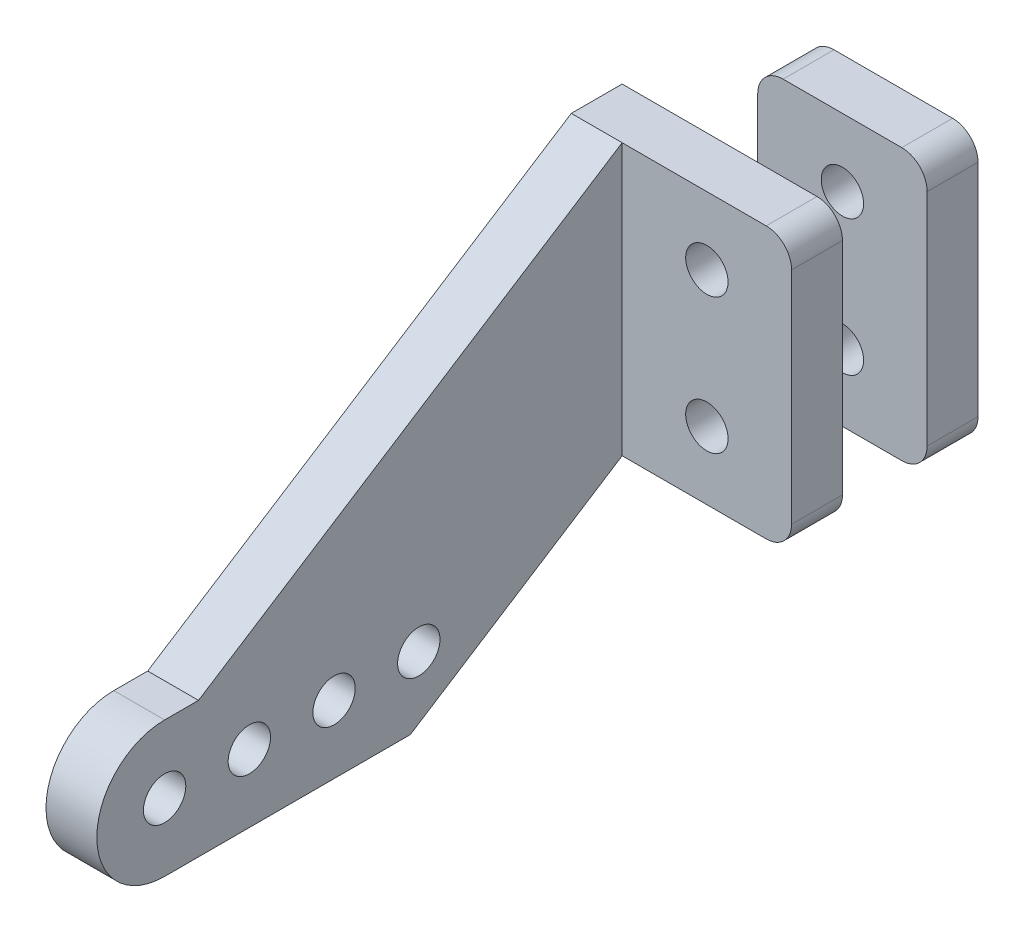
ISO-10303-21;
HEADER;
FILE_DESCRIPTION(('STEP AP214'),'2;1');
FILE_NAME('part.step','',(''),(''),'','','');
FILE_SCHEMA(('AUTOMOTIVE_DESIGN { 1 0 10303 214 1 1 1 1 }'));
ENDSEC;
DATA;
#1=APPLICATION_CONTEXT('core data for automotive mechanical design processes');
#2=APPLICATION_PROTOCOL_DEFINITION('international standard','automotive_design',2000,#1);
#3=PRODUCT_CONTEXT('',#1,'mechanical');
#4=PRODUCT('Part','Part','',(#3));
#5=PRODUCT_RELATED_PRODUCT_CATEGORY('part','',(#4));
#6=PRODUCT_DEFINITION_FORMATION('','',#4);
#7=PRODUCT_DEFINITION_CONTEXT('part definition',#1,'design');
#8=PRODUCT_DEFINITION('design','',#6,#7);
#9=PRODUCT_DEFINITION_SHAPE('','',#8);
#10=(LENGTH_UNIT() NAMED_UNIT(*) SI_UNIT(.MILLI.,.METRE.));
#11=(NAMED_UNIT(*) PLANE_ANGLE_UNIT() SI_UNIT($,.RADIAN.));
#12=(NAMED_UNIT(*) SI_UNIT($,.STERADIAN.) SOLID_ANGLE_UNIT());
#13=UNCERTAINTY_MEASURE_WITH_UNIT(LENGTH_MEASURE(1.E-05),#10,'distance_accuracy_value','');
#14=(GEOMETRIC_REPRESENTATION_CONTEXT(3) GLOBAL_UNCERTAINTY_ASSIGNED_CONTEXT((#13)) GLOBAL_UNIT_ASSIGNED_CONTEXT((#10,
#11,#12)) REPRESENTATION_CONTEXT('',''));
#15=CARTESIAN_POINT('',(0.,0.,0.));
#16=DIRECTION('',(0.,0.,1.));
#17=DIRECTION('',(1.,0.,0.));
#18=AXIS2_PLACEMENT_3D('',#15,#16,#17);
#19=CARTESIAN_POINT('',(8.,373.5,4.));
#20=DIRECTION('',(0.,0.,1.));
#21=DIRECTION('',(1.,0.,0.));
#22=AXIS2_PLACEMENT_3D('',#19,#20,#21);
#23=CYLINDRICAL_SURFACE('',#22,1.25);
#24=CARTESIAN_POINT('',(8.,373.5,2.5));
#25=DIRECTION('',(0.,0.,1.));
#26=DIRECTION('',(1.,0.,0.));
#27=AXIS2_PLACEMENT_3D('',#24,#25,#26);
#28=CIRCLE('',#27,1.25);
#29=CARTESIAN_POINT('',(9.25,373.5,2.5));
#30=VERTEX_POINT('',#29);
#31=EDGE_CURVE('P0_E114',#30,#30,#28,.T.);
#32=ORIENTED_EDGE('',*,*,#31,.F.);
#33=EDGE_LOOP('',(#32));
#34=FACE_BOUND('',#33,.T.);
#35=CARTESIAN_POINT('',(8.,373.5,5.5));
#36=DIRECTION('',(0.,0.,1.));
#37=DIRECTION('',(1.,0.,0.));
#38=AXIS2_PLACEMENT_3D('',#35,#36,#37);
#39=CIRCLE('',#38,1.25);
#40=CARTESIAN_POINT('',(9.25,373.5,5.5));
#41=VERTEX_POINT('',#40);
#42=EDGE_CURVE('P0_E203',#41,#41,#39,.T.);
#43=ORIENTED_EDGE('',*,*,#42,.T.);
#44=EDGE_LOOP('',(#43));
#45=FACE_BOUND('',#44,.T.);
#46=ADVANCED_FACE('P0_F15',(#34,#45),#23,.F.);
#47=CARTESIAN_POINT('',(8.,365.5,4.));
#48=DIRECTION('',(0.,0.,1.));
#49=DIRECTION('',(1.,0.,0.));
#50=AXIS2_PLACEMENT_3D('',#47,#48,#49);
#51=CYLINDRICAL_SURFACE('',#50,1.25);
#52=CARTESIAN_POINT('',(8.,365.5,2.5));
#53=DIRECTION('',(0.,0.,1.));
#54=DIRECTION('',(1.,0.,0.));
#55=AXIS2_PLACEMENT_3D('',#52,#53,#54);
#56=CIRCLE('',#55,1.25);
#57=CARTESIAN_POINT('',(9.25,365.5,2.5));
#58=VERTEX_POINT('',#57);
#59=EDGE_CURVE('P0_E189',#58,#58,#56,.T.);
#60=ORIENTED_EDGE('',*,*,#59,.F.);
#61=EDGE_LOOP('',(#60));
#62=FACE_BOUND('',#61,.T.);
#63=CARTESIAN_POINT('',(8.,365.5,5.5));
#64=DIRECTION('',(0.,0.,1.));
#65=DIRECTION('',(1.,0.,0.));
#66=AXIS2_PLACEMENT_3D('',#63,#64,#65);
#67=CIRCLE('',#66,1.25);
#68=CARTESIAN_POINT('',(9.25,365.5,5.5));
#69=VERTEX_POINT('',#68);
#70=EDGE_CURVE('P0_E205',#69,#69,#67,.T.);
#71=ORIENTED_EDGE('',*,*,#70,.T.);
#72=EDGE_LOOP('',(#71));
#73=FACE_BOUND('',#72,.T.);
#74=ADVANCED_FACE('P0_F374',(#62,#73),#51,.F.);
#75=CARTESIAN_POINT('',(11.5,376.,2.5));
#76=DIRECTION('',(0.,0.,1.));
#77=DIRECTION('',(1.,0.,0.));
#78=AXIS2_PLACEMENT_3D('',#75,#76,#77);
#79=CYLINDRICAL_SURFACE('',#78,1.5);
#80=CARTESIAN_POINT('',(11.5,376.,2.5));
#81=DIRECTION('',(0.,0.,1.));
#82=DIRECTION('',(1.,0.,0.));
#83=AXIS2_PLACEMENT_3D('',#80,#81,#82);
#84=CIRCLE('',#83,1.5);
#85=CARTESIAN_POINT('',(11.5,377.5,2.5));
#86=VERTEX_POINT('',#85);
#87=CARTESIAN_POINT('',(13.,376.,2.5));
#88=VERTEX_POINT('',#87);
#89=EDGE_CURVE('P0_E111',#86,#88,#84,.F.);
#90=ORIENTED_EDGE('',*,*,#89,.F.);
#91=DIRECTION('',(0.,0.,1.));
#92=VECTOR('',#91,1.);
#93=CARTESIAN_POINT('',(11.5,377.5,2.5));
#94=LINE('',#93,#92);
#95=CARTESIAN_POINT('',(11.5,377.5,5.5));
#96=VERTEX_POINT('',#95);
#97=EDGE_CURVE('P0_E108',#96,#86,#94,.F.);
#98=ORIENTED_EDGE('',*,*,#97,.F.);
#99=CARTESIAN_POINT('',(11.5,376.,5.5));
#100=DIRECTION('',(0.,0.,1.));
#101=DIRECTION('',(1.,0.,0.));
#102=AXIS2_PLACEMENT_3D('',#99,#100,#101);
#103=CIRCLE('',#102,1.5);
#104=CARTESIAN_POINT('',(13.,376.,5.5));
#105=VERTEX_POINT('',#104);
#106=EDGE_CURVE('P0_E19',#96,#105,#103,.F.);
#107=ORIENTED_EDGE('',*,*,#106,.T.);
#108=DIRECTION('',(0.,0.,-1.));
#109=VECTOR('',#108,1.);
#110=CARTESIAN_POINT('',(13.,376.,2.5));
#111=LINE('',#110,#109);
#112=EDGE_CURVE('P0_E106',#88,#105,#111,.F.);
#113=ORIENTED_EDGE('',*,*,#112,.F.);
#114=EDGE_LOOP('',(#90,#98,#107,#113));
#115=FACE_BOUND('',#114,.T.);
#116=ADVANCED_FACE('P0_F109',(#115),#79,.T.);
#117=CARTESIAN_POINT('',(13.,376.,2.5));
#118=DIRECTION('',(1.,0.,0.));
#119=DIRECTION('',(0.,0.,-1.));
#120=AXIS2_PLACEMENT_3D('',#117,#118,#119);
#121=PLANE('',#120);
#122=DIRECTION('',(0.,1.,0.));
#123=VECTOR('',#122,1.);
#124=CARTESIAN_POINT('',(13.,369.5,2.5));
#125=LINE('',#124,#123);
#126=CARTESIAN_POINT('',(13.,363.,2.5));
#127=VERTEX_POINT('',#126);
#128=EDGE_CURVE('P0_E187',#88,#127,#125,.F.);
#129=ORIENTED_EDGE('',*,*,#128,.F.);
#130=ORIENTED_EDGE('',*,*,#112,.T.);
#131=DIRECTION('',(0.,1.,0.));
#132=VECTOR('',#131,1.);
#133=CARTESIAN_POINT('',(13.,376.,5.5));
#134=LINE('',#133,#132);
#135=CARTESIAN_POINT('',(13.,363.,5.5));
#136=VERTEX_POINT('',#135);
#137=EDGE_CURVE('P0_E103',#105,#136,#134,.F.);
#138=ORIENTED_EDGE('',*,*,#137,.T.);
#139=DIRECTION('',(0.,0.,1.));
#140=VECTOR('',#139,1.);
#141=CARTESIAN_POINT('',(13.,363.,2.5));
#142=LINE('',#141,#140);
#143=EDGE_CURVE('P0_E135',#127,#136,#142,.T.);
#144=ORIENTED_EDGE('',*,*,#143,.F.);
#145=EDGE_LOOP('',(#129,#130,#138,#144));
#146=FACE_BOUND('',#145,.T.);
#147=ADVANCED_FACE('P0_F297',(#146),#121,.T.);
#148=CARTESIAN_POINT('',(13.,376.,5.5));
#149=DIRECTION('',(0.,0.,-1.));
#150=DIRECTION('',(-1.,0.,0.));
#151=AXIS2_PLACEMENT_3D('',#148,#149,#150);
#152=PLANE('',#151);
#153=ORIENTED_EDGE('',*,*,#42,.F.);
#154=EDGE_LOOP('',(#153));
#155=FACE_BOUND('',#154,.T.);
#156=ORIENTED_EDGE('',*,*,#70,.F.);
#157=EDGE_LOOP('',(#156));
#158=FACE_BOUND('',#157,.T.);
#159=DIRECTION('',(1.,0.,0.));
#160=VECTOR('',#159,1.);
#161=CARTESIAN_POINT('',(11.5,361.5,5.5));
#162=LINE('',#161,#160);
#163=CARTESIAN_POINT('',(11.5,361.5,5.5));
#164=VERTEX_POINT('',#163);
#165=CARTESIAN_POINT('',(3.,361.5,5.5));
#166=VERTEX_POINT('',#165);
#167=EDGE_CURVE('P0_E151',#164,#166,#162,.F.);
#168=ORIENTED_EDGE('',*,*,#167,.F.);
#169=CARTESIAN_POINT('',(11.5,363.,5.5));
#170=DIRECTION('',(0.,0.,1.));
#171=DIRECTION('',(1.,0.,0.));
#172=AXIS2_PLACEMENT_3D('',#169,#170,#171);
#173=CIRCLE('',#172,1.5);
#174=EDGE_CURVE('P0_E162',#136,#164,#173,.F.);
#175=ORIENTED_EDGE('',*,*,#174,.F.);
#176=ORIENTED_EDGE('',*,*,#137,.F.);
#177=ORIENTED_EDGE('',*,*,#106,.F.);
#178=DIRECTION('',(1.,0.,0.));
#179=VECTOR('',#178,1.);
#180=CARTESIAN_POINT('',(0.,377.5,5.5));
#181=LINE('',#180,#179);
#182=CARTESIAN_POINT('',(3.,377.5,5.49999999999999));
#183=VERTEX_POINT('',#182);
#184=EDGE_CURVE('P0_E100',#183,#96,#181,.T.);
#185=ORIENTED_EDGE('',*,*,#184,.F.);
#186=DIRECTION('',(0.,1.,0.));
#187=VECTOR('',#186,1.);
#188=CARTESIAN_POINT('',(3.,377.5,5.5));
#189=LINE('',#188,#187);
#190=EDGE_CURVE('P0_E132',#166,#183,#189,.T.);
#191=ORIENTED_EDGE('',*,*,#190,.F.);
#192=EDGE_LOOP('',(#168,#175,#176,#177,#185,#191));
#193=FACE_BOUND('',#192,.T.);
#194=ADVANCED_FACE('P0_F98',(#155,#158,#193),#152,.F.);
#195=CARTESIAN_POINT('',(11.5,363.,2.5));
#196=DIRECTION('',(0.,0.,1.));
#197=DIRECTION('',(1.,0.,0.));
#198=AXIS2_PLACEMENT_3D('',#195,#196,#197);
#199=CYLINDRICAL_SURFACE('',#198,1.5);
#200=CARTESIAN_POINT('',(11.5,363.,2.5));
#201=DIRECTION('',(0.,0.,1.));
#202=DIRECTION('',(1.,0.,0.));
#203=AXIS2_PLACEMENT_3D('',#200,#201,#202);
#204=CIRCLE('',#203,1.5);
#205=CARTESIAN_POINT('',(11.5,361.5,2.5));
#206=VERTEX_POINT('',#205);
#207=EDGE_CURVE('P0_E185',#127,#206,#204,.F.);
#208=ORIENTED_EDGE('',*,*,#207,.F.);
#209=ORIENTED_EDGE('',*,*,#143,.T.);
#210=ORIENTED_EDGE('',*,*,#174,.T.);
#211=DIRECTION('',(0.,0.,-1.));
#212=VECTOR('',#211,1.);
#213=CARTESIAN_POINT('',(11.5,361.5,2.5));
#214=LINE('',#213,#212);
#215=EDGE_CURVE('P0_E148',#206,#164,#214,.F.);
#216=ORIENTED_EDGE('',*,*,#215,.F.);
#217=EDGE_LOOP('',(#208,#209,#210,#216));
#218=FACE_BOUND('',#217,.T.);
#219=ADVANCED_FACE('P0_F295',(#218),#199,.T.);
#220=CARTESIAN_POINT('',(3.,377.5,5.5));
#221=DIRECTION('',(1.,0.,0.));
#222=DIRECTION('',(0.,0.,-1.));
#223=AXIS2_PLACEMENT_3D('',#220,#221,#222);
#224=PLANE('',#223);
#225=DIRECTION('',(0.,0.,-1.));
#226=VECTOR('',#225,1.);
#227=CARTESIAN_POINT('',(3.,353.5,18.));
#228=LINE('',#227,#226);
#229=CARTESIAN_POINT('',(3.,353.5,18.));
#230=VERTEX_POINT('',#229);
#231=CARTESIAN_POINT('',(3.,353.5,32.5));
#232=VERTEX_POINT('',#231);
#233=EDGE_CURVE('P0_E138',#230,#232,#228,.F.);
#234=ORIENTED_EDGE('',*,*,#233,.F.);
#235=DIRECTION('',(0.,0.539053696423367,-0.842271400661511));
#236=VECTOR('',#235,1.);
#237=CARTESIAN_POINT('',(3.,361.5,5.5));
#238=LINE('',#237,#236);
#239=EDGE_CURVE('P0_E145',#166,#230,#238,.F.);
#240=ORIENTED_EDGE('',*,*,#239,.F.);
#241=ORIENTED_EDGE('',*,*,#190,.T.);
#242=DIRECTION('',(0.,-0.539053696423367,0.842271400661511));
#243=VECTOR('',#242,1.);
#244=CARTESIAN_POINT('',(3.,361.5,30.5));
#245=LINE('',#244,#243);
#246=CARTESIAN_POINT('',(3.,361.5,30.5));
#247=VERTEX_POINT('',#246);
#248=EDGE_CURVE('P0_E228',#247,#183,#245,.F.);
#249=ORIENTED_EDGE('',*,*,#248,.F.);
#250=DIRECTION('',(0.,0.,1.));
#251=VECTOR('',#250,1.);
#252=CARTESIAN_POINT('',(3.,361.5,32.5));
#253=LINE('',#252,#251);
#254=CARTESIAN_POINT('',(3.,361.5,32.5));
#255=VERTEX_POINT('',#254);
#256=EDGE_CURVE('P0_E229',#255,#247,#253,.F.);
#257=ORIENTED_EDGE('',*,*,#256,.F.);
#258=CARTESIAN_POINT('',(3.,357.5,32.5));
#259=DIRECTION('',(1.,0.,0.));
#260=DIRECTION('',(0.,0.,-1.));
#261=AXIS2_PLACEMENT_3D('',#258,#259,#260);
#262=CIRCLE('',#261,4.);
#263=EDGE_CURVE('P0_E181',#232,#255,#262,.F.);
#264=ORIENTED_EDGE('',*,*,#263,.F.);
#265=EDGE_LOOP('',(#234,#240,#241,#249,#257,#264));
#266=FACE_BOUND('',#265,.T.);
#267=CARTESIAN_POINT('',(3.,357.5,17.5));
#268=DIRECTION('',(1.,0.,0.));
#269=DIRECTION('',(0.,0.,-1.));
#270=AXIS2_PLACEMENT_3D('',#267,#268,#269);
#271=CIRCLE('',#270,1.25);
#272=CARTESIAN_POINT('',(3.,357.5,16.25));
#273=VERTEX_POINT('',#272);
#274=EDGE_CURVE('P0_E134',#273,#273,#271,.F.);
#275=ORIENTED_EDGE('',*,*,#274,.T.);
#276=EDGE_LOOP('',(#275));
#277=FACE_BOUND('',#276,.T.);
#278=CARTESIAN_POINT('',(3.,357.5,22.5));
#279=DIRECTION('',(1.,0.,0.));
#280=DIRECTION('',(0.,0.,-1.));
#281=AXIS2_PLACEMENT_3D('',#278,#279,#280);
#282=CIRCLE('',#281,1.25);
#283=CARTESIAN_POINT('',(3.,357.5,21.25));
#284=VERTEX_POINT('',#283);
#285=EDGE_CURVE('P0_E196',#284,#284,#282,.F.);
#286=ORIENTED_EDGE('',*,*,#285,.T.);
#287=EDGE_LOOP('',(#286));
#288=FACE_BOUND('',#287,.T.);
#289=CARTESIAN_POINT('',(3.,357.5,27.5));
#290=DIRECTION('',(1.,0.,0.));
#291=DIRECTION('',(0.,0.,-1.));
#292=AXIS2_PLACEMENT_3D('',#289,#290,#291);
#293=CIRCLE('',#292,1.25);
#294=CARTESIAN_POINT('',(3.,357.5,26.25));
#295=VERTEX_POINT('',#294);
#296=EDGE_CURVE('P0_E124',#295,#295,#293,.F.);
#297=ORIENTED_EDGE('',*,*,#296,.T.);
#298=EDGE_LOOP('',(#297));
#299=FACE_BOUND('',#298,.T.);
#300=CARTESIAN_POINT('',(3.,357.5,32.5));
#301=DIRECTION('',(1.,0.,0.));
#302=DIRECTION('',(0.,0.,-1.));
#303=AXIS2_PLACEMENT_3D('',#300,#301,#302);
#304=CIRCLE('',#303,1.25);
#305=CARTESIAN_POINT('',(3.,357.5,31.25));
#306=VERTEX_POINT('',#305);
#307=EDGE_CURVE('P0_E121',#306,#306,#304,.F.);
#308=ORIENTED_EDGE('',*,*,#307,.T.);
#309=EDGE_LOOP('',(#308));
#310=FACE_BOUND('',#309,.T.);
#311=ADVANCED_FACE('P0_F276',(#266,#277,#288,#299,#310),#224,.T.);
#312=CARTESIAN_POINT('',(1.5,357.5,17.5));
#313=DIRECTION('',(1.,0.,0.));
#314=DIRECTION('',(0.,0.,-1.));
#315=AXIS2_PLACEMENT_3D('',#312,#313,#314);
#316=CYLINDRICAL_SURFACE('',#315,1.25);
#317=CARTESIAN_POINT('',(0.,357.5,17.5));
#318=DIRECTION('',(1.,0.,0.));
#319=DIRECTION('',(0.,0.,-1.));
#320=AXIS2_PLACEMENT_3D('',#317,#318,#319);
#321=CIRCLE('',#320,1.25);
#322=CARTESIAN_POINT('',(0.,357.5,16.25));
#323=VERTEX_POINT('',#322);
#324=EDGE_CURVE('P0_E178',#323,#323,#321,.T.);
#325=ORIENTED_EDGE('',*,*,#324,.F.);
#326=EDGE_LOOP('',(#325));
#327=FACE_BOUND('',#326,.T.);
#328=ORIENTED_EDGE('',*,*,#274,.F.);
#329=EDGE_LOOP('',(#328));
#330=FACE_BOUND('',#329,.T.);
#331=ADVANCED_FACE('P0_F313',(#327,#330),#316,.F.);
#332=CARTESIAN_POINT('',(1.5,357.5,22.5));
#333=DIRECTION('',(1.,0.,0.));
#334=DIRECTION('',(0.,0.,-1.));
#335=AXIS2_PLACEMENT_3D('',#332,#333,#334);
#336=CYLINDRICAL_SURFACE('',#335,1.25);
#337=CARTESIAN_POINT('',(0.,357.5,22.5));
#338=DIRECTION('',(1.,0.,0.));
#339=DIRECTION('',(0.,0.,-1.));
#340=AXIS2_PLACEMENT_3D('',#337,#338,#339);
#341=CIRCLE('',#340,1.25);
#342=CARTESIAN_POINT('',(0.,357.5,21.25));
#343=VERTEX_POINT('',#342);
#344=EDGE_CURVE('P0_E175',#343,#343,#341,.T.);
#345=ORIENTED_EDGE('',*,*,#344,.F.);
#346=EDGE_LOOP('',(#345));
#347=FACE_BOUND('',#346,.T.);
#348=ORIENTED_EDGE('',*,*,#285,.F.);
#349=EDGE_LOOP('',(#348));
#350=FACE_BOUND('',#349,.T.);
#351=ADVANCED_FACE('P0_F316',(#347,#350),#336,.F.);
#352=CARTESIAN_POINT('',(1.5,357.5,27.5));
#353=DIRECTION('',(1.,0.,0.));
#354=DIRECTION('',(0.,0.,-1.));
#355=AXIS2_PLACEMENT_3D('',#352,#353,#354);
#356=CYLINDRICAL_SURFACE('',#355,1.25);
#357=CARTESIAN_POINT('',(0.,357.5,27.5));
#358=DIRECTION('',(1.,0.,0.));
#359=DIRECTION('',(0.,0.,-1.));
#360=AXIS2_PLACEMENT_3D('',#357,#358,#359);
#361=CIRCLE('',#360,1.25);
#362=CARTESIAN_POINT('',(0.,357.5,26.25));
#363=VERTEX_POINT('',#362);
#364=EDGE_CURVE('P0_E172',#363,#363,#361,.T.);
#365=ORIENTED_EDGE('',*,*,#364,.F.);
#366=EDGE_LOOP('',(#365));
#367=FACE_BOUND('',#366,.T.);
#368=ORIENTED_EDGE('',*,*,#296,.F.);
#369=EDGE_LOOP('',(#368));
#370=FACE_BOUND('',#369,.T.);
#371=ADVANCED_FACE('P0_F330',(#367,#370),#356,.F.);
#372=CARTESIAN_POINT('',(1.5,357.5,32.5));
#373=DIRECTION('',(1.,0.,0.));
#374=DIRECTION('',(0.,0.,-1.));
#375=AXIS2_PLACEMENT_3D('',#372,#373,#374);
#376=CYLINDRICAL_SURFACE('',#375,1.25);
#377=CARTESIAN_POINT('',(0.,357.5,32.5));
#378=DIRECTION('',(1.,0.,0.));
#379=DIRECTION('',(0.,0.,-1.));
#380=AXIS2_PLACEMENT_3D('',#377,#378,#379);
#381=CIRCLE('',#380,1.25);
#382=CARTESIAN_POINT('',(0.,357.5,31.25));
#383=VERTEX_POINT('',#382);
#384=EDGE_CURVE('P0_E168',#383,#383,#381,.T.);
#385=ORIENTED_EDGE('',*,*,#384,.F.);
#386=EDGE_LOOP('',(#385));
#387=FACE_BOUND('',#386,.T.);
#388=ORIENTED_EDGE('',*,*,#307,.F.);
#389=EDGE_LOOP('',(#388));
#390=FACE_BOUND('',#389,.T.);
#391=ADVANCED_FACE('P0_F328',(#387,#390),#376,.F.);
#392=CARTESIAN_POINT('',(0.,377.5,2.5));
#393=DIRECTION('',(0.,1.,0.));
#394=DIRECTION('',(0.,0.,1.));
#395=AXIS2_PLACEMENT_3D('',#392,#393,#394);
#396=PLANE('',#395);
#397=DIRECTION('',(-1.,0.,0.));
#398=VECTOR('',#397,1.);
#399=CARTESIAN_POINT('',(9.26516504294496,377.5,2.5));
#400=LINE('',#399,#398);
#401=CARTESIAN_POINT('',(0.,377.5,2.5));
#402=VERTEX_POINT('',#401);
#403=EDGE_CURVE('P0_E155',#402,#86,#400,.F.);
#404=ORIENTED_EDGE('',*,*,#403,.F.);
#405=DIRECTION('',(0.,0.,1.));
#406=VECTOR('',#405,1.);
#407=CARTESIAN_POINT('',(0.,377.5,2.5));
#408=LINE('',#407,#406);
#409=CARTESIAN_POINT('',(0.,377.5,5.49999999999999));
#410=VERTEX_POINT('',#409);
#411=EDGE_CURVE('P0_E171',#410,#402,#408,.F.);
#412=ORIENTED_EDGE('',*,*,#411,.F.);
#413=DIRECTION('',(1.,0.,0.));
#414=VECTOR('',#413,1.);
#415=CARTESIAN_POINT('',(0.,377.5,5.49999999999998));
#416=LINE('',#415,#414);
#417=EDGE_CURVE('P0_E119',#183,#410,#416,.F.);
#418=ORIENTED_EDGE('',*,*,#417,.F.);
#419=ORIENTED_EDGE('',*,*,#184,.T.);
#420=ORIENTED_EDGE('',*,*,#97,.T.);
#421=EDGE_LOOP('',(#404,#412,#418,#419,#420));
#422=FACE_BOUND('',#421,.T.);
#423=ADVANCED_FACE('P0_F117',(#422),#396,.T.);
#424=CARTESIAN_POINT('',(9.26516504294496,369.5,2.5));
#425=DIRECTION('',(0.,0.,-1.));
#426=DIRECTION('',(-1.,0.,0.));
#427=AXIS2_PLACEMENT_3D('',#424,#425,#426);
#428=PLANE('',#427);
#429=DIRECTION('',(0.,1.,0.));
#430=VECTOR('',#429,1.);
#431=CARTESIAN_POINT('',(0.,361.5,2.5));
#432=LINE('',#431,#430);
#433=CARTESIAN_POINT('',(0.,361.5,2.5));
#434=VERTEX_POINT('',#433);
#435=EDGE_CURVE('P0_E253',#402,#434,#432,.F.);
#436=ORIENTED_EDGE('',*,*,#435,.F.);
#437=ORIENTED_EDGE('',*,*,#403,.T.);
#438=ORIENTED_EDGE('',*,*,#89,.T.);
#439=ORIENTED_EDGE('',*,*,#128,.T.);
#440=ORIENTED_EDGE('',*,*,#207,.T.);
#441=DIRECTION('',(1.,0.,0.));
#442=VECTOR('',#441,1.);
#443=CARTESIAN_POINT('',(11.5,361.5,2.5));
#444=LINE('',#443,#442);
#445=EDGE_CURVE('P0_E154',#434,#206,#444,.T.);
#446=ORIENTED_EDGE('',*,*,#445,.F.);
#447=EDGE_LOOP('',(#436,#437,#438,#439,#440,#446));
#448=FACE_BOUND('',#447,.T.);
#449=ORIENTED_EDGE('',*,*,#59,.T.);
#450=EDGE_LOOP('',(#449));
#451=FACE_BOUND('',#450,.T.);
#452=ORIENTED_EDGE('',*,*,#31,.T.);
#453=EDGE_LOOP('',(#452));
#454=FACE_BOUND('',#453,.T.);
#455=ADVANCED_FACE('P0_F300',(#448,#451,#454),#428,.T.);
#456=CARTESIAN_POINT('',(11.5,361.5,2.5));
#457=DIRECTION('',(0.,-1.,0.));
#458=DIRECTION('',(0.,0.,-1.));
#459=AXIS2_PLACEMENT_3D('',#456,#457,#458);
#460=PLANE('',#459);
#461=ORIENTED_EDGE('',*,*,#445,.T.);
#462=ORIENTED_EDGE('',*,*,#215,.T.);
#463=ORIENTED_EDGE('',*,*,#167,.T.);
#464=DIRECTION('',(1.,0.,0.));
#465=VECTOR('',#464,1.);
#466=CARTESIAN_POINT('',(0.,361.5,5.5));
#467=LINE('',#466,#465);
#468=CARTESIAN_POINT('',(0.,361.5,5.5));
#469=VERTEX_POINT('',#468);
#470=EDGE_CURVE('P0_E142',#469,#166,#467,.T.);
#471=ORIENTED_EDGE('',*,*,#470,.F.);
#472=DIRECTION('',(0.,0.,1.));
#473=VECTOR('',#472,1.);
#474=CARTESIAN_POINT('',(0.,361.5,2.5));
#475=LINE('',#474,#473);
#476=EDGE_CURVE('P0_E244',#434,#469,#475,.T.);
#477=ORIENTED_EDGE('',*,*,#476,.F.);
#478=EDGE_LOOP('',(#461,#462,#463,#471,#477));
#479=FACE_BOUND('',#478,.T.);
#480=ADVANCED_FACE('P0_F290',(#479),#460,.T.);
#481=CARTESIAN_POINT('',(0.,361.5,5.5));
#482=DIRECTION('',(0.,-0.842271400661511,-0.539053696423367));
#483=DIRECTION('',(0.,0.539053696423367,-0.842271400661511));
#484=AXIS2_PLACEMENT_3D('',#481,#482,#483);
#485=PLANE('',#484);
#486=DIRECTION('',(0.,-0.539053696423368,0.842271400661511));
#487=VECTOR('',#486,1.);
#488=CARTESIAN_POINT('',(0.,361.5,5.5));
#489=LINE('',#488,#487);
#490=CARTESIAN_POINT('',(0.,353.5,18.));
#491=VERTEX_POINT('',#490);
#492=EDGE_CURVE('P0_E223',#469,#491,#489,.T.);
#493=ORIENTED_EDGE('',*,*,#492,.F.);
#494=ORIENTED_EDGE('',*,*,#470,.T.);
#495=ORIENTED_EDGE('',*,*,#239,.T.);
#496=DIRECTION('',(1.,0.,0.));
#497=VECTOR('',#496,1.);
#498=CARTESIAN_POINT('',(0.,353.5,18.));
#499=LINE('',#498,#497);
#500=EDGE_CURVE('P0_E141',#491,#230,#499,.T.);
#501=ORIENTED_EDGE('',*,*,#500,.F.);
#502=EDGE_LOOP('',(#493,#494,#495,#501));
#503=FACE_BOUND('',#502,.T.);
#504=ADVANCED_FACE('P0_F288',(#503),#485,.T.);
#505=CARTESIAN_POINT('',(0.,353.5,18.));
#506=DIRECTION('',(0.,-1.,0.));
#507=DIRECTION('',(0.,0.,-1.));
#508=AXIS2_PLACEMENT_3D('',#505,#506,#507);
#509=PLANE('',#508);
#510=DIRECTION('',(0.,0.,1.));
#511=VECTOR('',#510,1.);
#512=CARTESIAN_POINT('',(0.,353.5,2.5));
#513=LINE('',#512,#511);
#514=CARTESIAN_POINT('',(0.,353.5,32.5));
#515=VERTEX_POINT('',#514);
#516=EDGE_CURVE('P0_E167',#491,#515,#513,.T.);
#517=ORIENTED_EDGE('',*,*,#516,.F.);
#518=ORIENTED_EDGE('',*,*,#500,.T.);
#519=ORIENTED_EDGE('',*,*,#233,.T.);
#520=DIRECTION('',(1.,0.,0.));
#521=VECTOR('',#520,1.);
#522=CARTESIAN_POINT('',(0.,353.5,32.5));
#523=LINE('',#522,#521);
#524=EDGE_CURVE('P0_E184',#515,#232,#523,.T.);
#525=ORIENTED_EDGE('',*,*,#524,.F.);
#526=EDGE_LOOP('',(#517,#518,#519,#525));
#527=FACE_BOUND('',#526,.T.);
#528=ADVANCED_FACE('P0_F285',(#527),#509,.T.);
#529=CARTESIAN_POINT('',(0.,357.5,32.5));
#530=DIRECTION('',(1.,0.,0.));
#531=DIRECTION('',(0.,0.,-1.));
#532=AXIS2_PLACEMENT_3D('',#529,#530,#531);
#533=CYLINDRICAL_SURFACE('',#532,4.);
#534=CARTESIAN_POINT('',(0.,357.5,32.5));
#535=DIRECTION('',(1.,0.,0.));
#536=DIRECTION('',(0.,0.,-1.));
#537=AXIS2_PLACEMENT_3D('',#534,#535,#536);
#538=CIRCLE('',#537,4.);
#539=CARTESIAN_POINT('',(0.,361.5,32.5));
#540=VERTEX_POINT('',#539);
#541=EDGE_CURVE('P0_E164',#515,#540,#538,.F.);
#542=ORIENTED_EDGE('',*,*,#541,.F.);
#543=ORIENTED_EDGE('',*,*,#524,.T.);
#544=ORIENTED_EDGE('',*,*,#263,.T.);
#545=DIRECTION('',(1.,0.,0.));
#546=VECTOR('',#545,1.);
#547=CARTESIAN_POINT('',(0.,361.5,32.5));
#548=LINE('',#547,#546);
#549=EDGE_CURVE('P0_E226',#540,#255,#548,.T.);
#550=ORIENTED_EDGE('',*,*,#549,.F.);
#551=EDGE_LOOP('',(#542,#543,#544,#550));
#552=FACE_BOUND('',#551,.T.);
#553=ADVANCED_FACE('P0_F282',(#552),#533,.T.);
#554=CARTESIAN_POINT('',(0.,361.5,32.5));
#555=DIRECTION('',(0.,1.,0.));
#556=DIRECTION('',(0.,0.,1.));
#557=AXIS2_PLACEMENT_3D('',#554,#555,#556);
#558=PLANE('',#557);
#559=DIRECTION('',(0.,0.,1.));
#560=VECTOR('',#559,1.);
#561=CARTESIAN_POINT('',(0.,361.5,2.5));
#562=LINE('',#561,#560);
#563=CARTESIAN_POINT('',(0.,361.5,30.5));
#564=VERTEX_POINT('',#563);
#565=EDGE_CURVE('P0_E25',#540,#564,#562,.F.);
#566=ORIENTED_EDGE('',*,*,#565,.F.);
#567=ORIENTED_EDGE('',*,*,#549,.T.);
#568=ORIENTED_EDGE('',*,*,#256,.T.);
#569=DIRECTION('',(1.,0.,0.));
#570=VECTOR('',#569,1.);
#571=CARTESIAN_POINT('',(0.,361.5,30.5));
#572=LINE('',#571,#570);
#573=EDGE_CURVE('P0_E34',#564,#247,#572,.T.);
#574=ORIENTED_EDGE('',*,*,#573,.F.);
#575=EDGE_LOOP('',(#566,#567,#568,#574));
#576=FACE_BOUND('',#575,.T.);
#577=ADVANCED_FACE('P0_F279',(#576),#558,.T.);
#578=CARTESIAN_POINT('',(0.,361.5,30.5));
#579=DIRECTION('',(0.,0.842271400661511,0.539053696423367));
#580=DIRECTION('',(0.,-0.539053696423367,0.842271400661511));
#581=AXIS2_PLACEMENT_3D('',#578,#579,#580);
#582=PLANE('',#581);
#583=DIRECTION('',(0.,0.539053696423368,-0.842271400661511));
#584=VECTOR('',#583,1.);
#585=CARTESIAN_POINT('',(0.,361.5,30.5));
#586=LINE('',#585,#584);
#587=EDGE_CURVE('P0_E10',#564,#410,#586,.T.);
#588=ORIENTED_EDGE('',*,*,#587,.F.);
#589=ORIENTED_EDGE('',*,*,#573,.T.);
#590=ORIENTED_EDGE('',*,*,#248,.T.);
#591=ORIENTED_EDGE('',*,*,#417,.T.);
#592=EDGE_LOOP('',(#588,#589,#590,#591));
#593=FACE_BOUND('',#592,.T.);
#594=ADVANCED_FACE('P0_F274',(#593),#582,.T.);
#595=CARTESIAN_POINT('',(0.,361.5,2.5));
#596=DIRECTION('',(-1.,0.,0.));
#597=DIRECTION('',(0.,0.,1.));
#598=AXIS2_PLACEMENT_3D('',#595,#596,#597);
#599=PLANE('',#598);
#600=ORIENTED_EDGE('',*,*,#565,.T.);
#601=ORIENTED_EDGE('',*,*,#587,.T.);
#602=ORIENTED_EDGE('',*,*,#411,.T.);
#603=ORIENTED_EDGE('',*,*,#435,.T.);
#604=ORIENTED_EDGE('',*,*,#476,.T.);
#605=ORIENTED_EDGE('',*,*,#492,.T.);
#606=ORIENTED_EDGE('',*,*,#516,.T.);
#607=ORIENTED_EDGE('',*,*,#541,.T.);
#608=EDGE_LOOP('',(#600,#601,#602,#603,#604,#605,#606,#607));
#609=FACE_BOUND('',#608,.T.);
#610=ORIENTED_EDGE('',*,*,#384,.T.);
#611=EDGE_LOOP('',(#610));
#612=FACE_BOUND('',#611,.T.);
#613=ORIENTED_EDGE('',*,*,#364,.T.);
#614=EDGE_LOOP('',(#613));
#615=FACE_BOUND('',#614,.T.);
#616=ORIENTED_EDGE('',*,*,#344,.T.);
#617=EDGE_LOOP('',(#616));
#618=FACE_BOUND('',#617,.T.);
#619=ORIENTED_EDGE('',*,*,#324,.T.);
#620=EDGE_LOOP('',(#619));
#621=FACE_BOUND('',#620,.T.);
#622=ADVANCED_FACE('P0_F17',(#609,#612,#615,#618,#621),#599,.T.);
#623=CLOSED_SHELL('',(#46,#74,#116,#147,#194,#219,#311,#331,#351,#371,#391,#423,#455,#480,#504,
#528,#553,#577,#594,#622));
#624=MANIFOLD_SOLID_BREP('P0_B1',#623);
#625=CARTESIAN_POINT('',(3.,376.,-2.5));
#626=DIRECTION('',(0.,0.,-1.));
#627=DIRECTION('',(-1.,0.,0.));
#628=AXIS2_PLACEMENT_3D('',#625,#626,#627);
#629=PLANE('',#628);
#630=DIRECTION('',(0.,1.,0.));
#631=VECTOR('',#630,1.);
#632=CARTESIAN_POINT('',(3.,363.,-2.5));
#633=LINE('',#632,#631);
#634=CARTESIAN_POINT('',(3.,363.,-2.5));
#635=VERTEX_POINT('',#634);
#636=CARTESIAN_POINT('',(3.,376.,-2.5));
#637=VERTEX_POINT('',#636);
#638=EDGE_CURVE('P1_E97',#635,#637,#633,.T.);
#639=ORIENTED_EDGE('',*,*,#638,.F.);
#640=CARTESIAN_POINT('',(4.5,363.,-2.5));
#641=DIRECTION('',(0.,0.,1.));
#642=DIRECTION('',(1.,0.,0.));
#643=AXIS2_PLACEMENT_3D('',#640,#641,#642);
#644=CIRCLE('',#643,1.5);
#645=CARTESIAN_POINT('',(4.5,361.5,-2.5));
#646=VERTEX_POINT('',#645);
#647=EDGE_CURVE('P1_E136',#646,#635,#644,.F.);
#648=ORIENTED_EDGE('',*,*,#647,.F.);
#649=DIRECTION('',(1.,0.,0.));
#650=VECTOR('',#649,1.);
#651=CARTESIAN_POINT('',(11.5,361.5,-2.5));
#652=LINE('',#651,#650);
#653=CARTESIAN_POINT('',(11.5,361.5,-2.5));
#654=VERTEX_POINT('',#653);
#655=EDGE_CURVE('P1_E110',#654,#646,#652,.F.);
#656=ORIENTED_EDGE('',*,*,#655,.F.);
#657=CARTESIAN_POINT('',(11.5,363.,-2.5));
#658=DIRECTION('',(0.,0.,1.));
#659=DIRECTION('',(1.,0.,0.));
#660=AXIS2_PLACEMENT_3D('',#657,#658,#659);
#661=CIRCLE('',#660,1.5);
#662=CARTESIAN_POINT('',(13.,363.,-2.5));
#663=VERTEX_POINT('',#662);
#664=EDGE_CURVE('P1_E140',#663,#654,#661,.F.);
#665=ORIENTED_EDGE('',*,*,#664,.F.);
#666=DIRECTION('',(0.,1.,0.));
#667=VECTOR('',#666,1.);
#668=CARTESIAN_POINT('',(13.,376.,-2.5));
#669=LINE('',#668,#667);
#670=CARTESIAN_POINT('',(13.,376.,-2.5));
#671=VERTEX_POINT('',#670);
#672=EDGE_CURVE('P1_E116',#671,#663,#669,.F.);
#673=ORIENTED_EDGE('',*,*,#672,.F.);
#674=CARTESIAN_POINT('',(11.5,376.,-2.5));
#675=DIRECTION('',(0.,0.,1.));
#676=DIRECTION('',(1.,0.,0.));
#677=AXIS2_PLACEMENT_3D('',#674,#675,#676);
#678=CIRCLE('',#677,1.5);
#679=CARTESIAN_POINT('',(11.5,377.5,-2.5));
#680=VERTEX_POINT('',#679);
#681=EDGE_CURVE('P1_E85',#680,#671,#678,.F.);
#682=ORIENTED_EDGE('',*,*,#681,.F.);
#683=DIRECTION('',(1.,0.,0.));
#684=VECTOR('',#683,1.);
#685=CARTESIAN_POINT('',(4.5,377.5,-2.5));
#686=LINE('',#685,#684);
#687=CARTESIAN_POINT('',(4.5,377.5,-2.5));
#688=VERTEX_POINT('',#687);
#689=EDGE_CURVE('P1_E82',#688,#680,#686,.T.);
#690=ORIENTED_EDGE('',*,*,#689,.F.);
#691=CARTESIAN_POINT('',(4.5,376.,-2.5));
#692=DIRECTION('',(0.,0.,1.));
#693=DIRECTION('',(1.,0.,0.));
#694=AXIS2_PLACEMENT_3D('',#691,#692,#693);
#695=CIRCLE('',#694,1.5);
#696=EDGE_CURVE('P1_E79',#637,#688,#695,.F.);
#697=ORIENTED_EDGE('',*,*,#696,.F.);
#698=EDGE_LOOP('',(#639,#648,#656,#665,#673,#682,#690,#697));
#699=FACE_BOUND('',#698,.T.);
#700=CARTESIAN_POINT('',(8.,373.5,-2.5));
#701=DIRECTION('',(0.,0.,1.));
#702=DIRECTION('',(1.,0.,0.));
#703=AXIS2_PLACEMENT_3D('',#700,#701,#702);
#704=CIRCLE('',#703,1.25);
#705=CARTESIAN_POINT('',(9.25,373.5,-2.5));
#706=VERTEX_POINT('',#705);
#707=EDGE_CURVE('P1_E115',#706,#706,#704,.F.);
#708=ORIENTED_EDGE('',*,*,#707,.T.);
#709=EDGE_LOOP('',(#708));
#710=FACE_BOUND('',#709,.T.);
#711=CARTESIAN_POINT('',(8.,365.5,-2.5));
#712=DIRECTION('',(0.,0.,1.));
#713=DIRECTION('',(1.,0.,0.));
#714=AXIS2_PLACEMENT_3D('',#711,#712,#713);
#715=CIRCLE('',#714,1.25);
#716=CARTESIAN_POINT('',(9.25,365.5,-2.5));
#717=VERTEX_POINT('',#716);
#718=EDGE_CURVE('P1_E19',#717,#717,#715,.F.);
#719=ORIENTED_EDGE('',*,*,#718,.T.);
#720=EDGE_LOOP('',(#719));
#721=FACE_BOUND('',#720,.T.);
#722=ADVANCED_FACE('P1_F15',(#699,#710,#721),#629,.F.);
#723=CARTESIAN_POINT('',(8.,365.5,-4.));
#724=DIRECTION('',(0.,0.,1.));
#725=DIRECTION('',(1.,0.,0.));
#726=AXIS2_PLACEMENT_3D('',#723,#724,#725);
#727=CYLINDRICAL_SURFACE('',#726,1.25);
#728=CARTESIAN_POINT('',(8.,365.5,-5.5));
#729=DIRECTION('',(0.,0.,1.));
#730=DIRECTION('',(1.,0.,0.));
#731=AXIS2_PLACEMENT_3D('',#728,#729,#730);
#732=CIRCLE('',#731,1.25);
#733=CARTESIAN_POINT('',(9.25,365.5,-5.5));
#734=VERTEX_POINT('',#733);
#735=EDGE_CURVE('P1_E133',#734,#734,#732,.T.);
#736=ORIENTED_EDGE('',*,*,#735,.F.);
#737=EDGE_LOOP('',(#736));
#738=FACE_BOUND('',#737,.T.);
#739=ORIENTED_EDGE('',*,*,#718,.F.);
#740=EDGE_LOOP('',(#739));
#741=FACE_BOUND('',#740,.T.);
#742=ADVANCED_FACE('P1_F148',(#738,#741),#727,.F.);
#743=CARTESIAN_POINT('',(8.,373.5,-4.));
#744=DIRECTION('',(0.,0.,1.));
#745=DIRECTION('',(1.,0.,0.));
#746=AXIS2_PLACEMENT_3D('',#743,#744,#745);
#747=CYLINDRICAL_SURFACE('',#746,1.25);
#748=CARTESIAN_POINT('',(8.,373.5,-5.5));
#749=DIRECTION('',(0.,0.,1.));
#750=DIRECTION('',(1.,0.,0.));
#751=AXIS2_PLACEMENT_3D('',#748,#749,#750);
#752=CIRCLE('',#751,1.25);
#753=CARTESIAN_POINT('',(9.25,373.5,-5.5));
#754=VERTEX_POINT('',#753);
#755=EDGE_CURVE('P1_E130',#754,#754,#752,.T.);
#756=ORIENTED_EDGE('',*,*,#755,.F.);
#757=EDGE_LOOP('',(#756));
#758=FACE_BOUND('',#757,.T.);
#759=ORIENTED_EDGE('',*,*,#707,.F.);
#760=EDGE_LOOP('',(#759));
#761=FACE_BOUND('',#760,.T.);
#762=ADVANCED_FACE('P1_F150',(#758,#761),#747,.F.);
#763=CARTESIAN_POINT('',(3.,363.,-5.5));
#764=DIRECTION('',(-1.,0.,0.));
#765=DIRECTION('',(0.,0.,1.));
#766=AXIS2_PLACEMENT_3D('',#763,#764,#765);
#767=PLANE('',#766);
#768=DIRECTION('',(0.,1.,0.));
#769=VECTOR('',#768,1.);
#770=CARTESIAN_POINT('',(3.,369.5,-5.5));
#771=LINE('',#770,#769);
#772=CARTESIAN_POINT('',(3.,363.,-5.5));
#773=VERTEX_POINT('',#772);
#774=CARTESIAN_POINT('',(3.,376.,-5.5));
#775=VERTEX_POINT('',#774);
#776=EDGE_CURVE('P1_E129',#773,#775,#771,.T.);
#777=ORIENTED_EDGE('',*,*,#776,.F.);
#778=DIRECTION('',(0.,0.,1.));
#779=VECTOR('',#778,1.);
#780=CARTESIAN_POINT('',(3.,363.,-5.5));
#781=LINE('',#780,#779);
#782=EDGE_CURVE('P1_E139',#635,#773,#781,.F.);
#783=ORIENTED_EDGE('',*,*,#782,.F.);
#784=ORIENTED_EDGE('',*,*,#638,.T.);
#785=DIRECTION('',(0.,0.,1.));
#786=VECTOR('',#785,1.);
#787=CARTESIAN_POINT('',(3.,376.,-5.5));
#788=LINE('',#787,#786);
#789=EDGE_CURVE('P1_E90',#775,#637,#788,.T.);
#790=ORIENTED_EDGE('',*,*,#789,.F.);
#791=EDGE_LOOP('',(#777,#783,#784,#790));
#792=FACE_BOUND('',#791,.T.);
#793=ADVANCED_FACE('P1_F156',(#792),#767,.T.);
#794=CARTESIAN_POINT('',(4.5,376.,-5.5));
#795=DIRECTION('',(0.,0.,1.));
#796=DIRECTION('',(1.,0.,0.));
#797=AXIS2_PLACEMENT_3D('',#794,#795,#796);
#798=CYLINDRICAL_SURFACE('',#797,1.5);
#799=CARTESIAN_POINT('',(4.5,376.,-5.5));
#800=DIRECTION('',(0.,0.,1.));
#801=DIRECTION('',(1.,0.,0.));
#802=AXIS2_PLACEMENT_3D('',#799,#800,#801);
#803=CIRCLE('',#802,1.5);
#804=CARTESIAN_POINT('',(4.5,377.5,-5.5));
#805=VERTEX_POINT('',#804);
#806=EDGE_CURVE('P1_E127',#775,#805,#803,.F.);
#807=ORIENTED_EDGE('',*,*,#806,.F.);
#808=ORIENTED_EDGE('',*,*,#789,.T.);
#809=ORIENTED_EDGE('',*,*,#696,.T.);
#810=DIRECTION('',(0.,0.,1.));
#811=VECTOR('',#810,1.);
#812=CARTESIAN_POINT('',(4.5,377.5,-5.5));
#813=LINE('',#812,#811);
#814=EDGE_CURVE('P1_E89',#805,#688,#813,.T.);
#815=ORIENTED_EDGE('',*,*,#814,.F.);
#816=EDGE_LOOP('',(#807,#808,#809,#815));
#817=FACE_BOUND('',#816,.T.);
#818=ADVANCED_FACE('P1_F95',(#817),#798,.T.);
#819=CARTESIAN_POINT('',(4.5,377.5,-5.5));
#820=DIRECTION('',(0.,1.,0.));
#821=DIRECTION('',(0.,0.,1.));
#822=AXIS2_PLACEMENT_3D('',#819,#820,#821);
#823=PLANE('',#822);
#824=DIRECTION('',(-1.,0.,0.));
#825=VECTOR('',#824,1.);
#826=CARTESIAN_POINT('',(8.,377.5,-5.5));
#827=LINE('',#826,#825);
#828=CARTESIAN_POINT('',(11.5,377.5,-5.5));
#829=VERTEX_POINT('',#828);
#830=EDGE_CURVE('P1_E101',#805,#829,#827,.F.);
#831=ORIENTED_EDGE('',*,*,#830,.F.);
#832=ORIENTED_EDGE('',*,*,#814,.T.);
#833=ORIENTED_EDGE('',*,*,#689,.T.);
#834=DIRECTION('',(0.,0.,1.));
#835=VECTOR('',#834,1.);
#836=CARTESIAN_POINT('',(11.5,377.5,-5.5));
#837=LINE('',#836,#835);
#838=EDGE_CURVE('P1_E104',#829,#680,#837,.T.);
#839=ORIENTED_EDGE('',*,*,#838,.F.);
#840=EDGE_LOOP('',(#831,#832,#833,#839));
#841=FACE_BOUND('',#840,.T.);
#842=ADVANCED_FACE('P1_F99',(#841),#823,.T.);
#843=CARTESIAN_POINT('',(11.5,376.,-5.5));
#844=DIRECTION('',(0.,0.,1.));
#845=DIRECTION('',(1.,0.,0.));
#846=AXIS2_PLACEMENT_3D('',#843,#844,#845);
#847=CYLINDRICAL_SURFACE('',#846,1.5);
#848=CARTESIAN_POINT('',(11.5,376.,-5.5));
#849=DIRECTION('',(0.,0.,1.));
#850=DIRECTION('',(1.,0.,0.));
#851=AXIS2_PLACEMENT_3D('',#848,#849,#850);
#852=CIRCLE('',#851,1.5);
#853=CARTESIAN_POINT('',(13.,376.,-5.5));
#854=VERTEX_POINT('',#853);
#855=EDGE_CURVE('P1_E124',#829,#854,#852,.F.);
#856=ORIENTED_EDGE('',*,*,#855,.F.);
#857=ORIENTED_EDGE('',*,*,#838,.T.);
#858=ORIENTED_EDGE('',*,*,#681,.T.);
#859=DIRECTION('',(0.,0.,-1.));
#860=VECTOR('',#859,1.);
#861=CARTESIAN_POINT('',(13.,376.,-5.5));
#862=LINE('',#861,#860);
#863=EDGE_CURVE('P1_E118',#854,#671,#862,.F.);
#864=ORIENTED_EDGE('',*,*,#863,.F.);
#865=EDGE_LOOP('',(#856,#857,#858,#864));
#866=FACE_BOUND('',#865,.T.);
#867=ADVANCED_FACE('P1_F194',(#866),#847,.T.);
#868=CARTESIAN_POINT('',(13.,376.,-5.5));
#869=DIRECTION('',(1.,0.,0.));
#870=DIRECTION('',(0.,0.,-1.));
#871=AXIS2_PLACEMENT_3D('',#868,#869,#870);
#872=PLANE('',#871);
#873=DIRECTION('',(0.,1.,0.));
#874=VECTOR('',#873,1.);
#875=CARTESIAN_POINT('',(13.,369.5,-5.5));
#876=LINE('',#875,#874);
#877=CARTESIAN_POINT('',(13.,363.,-5.5));
#878=VERTEX_POINT('',#877);
#879=EDGE_CURVE('P1_E123',#854,#878,#876,.F.);
#880=ORIENTED_EDGE('',*,*,#879,.F.);
#881=ORIENTED_EDGE('',*,*,#863,.T.);
#882=ORIENTED_EDGE('',*,*,#672,.T.);
#883=DIRECTION('',(0.,0.,1.));
#884=VECTOR('',#883,1.);
#885=CARTESIAN_POINT('',(13.,363.,-5.5));
#886=LINE('',#885,#884);
#887=EDGE_CURVE('P1_E113',#878,#663,#886,.T.);
#888=ORIENTED_EDGE('',*,*,#887,.F.);
#889=EDGE_LOOP('',(#880,#881,#882,#888));
#890=FACE_BOUND('',#889,.T.);
#891=ADVANCED_FACE('P1_F191',(#890),#872,.T.);
#892=CARTESIAN_POINT('',(11.5,363.,-5.5));
#893=DIRECTION('',(0.,0.,1.));
#894=DIRECTION('',(1.,0.,0.));
#895=AXIS2_PLACEMENT_3D('',#892,#893,#894);
#896=CYLINDRICAL_SURFACE('',#895,1.5);
#897=CARTESIAN_POINT('',(11.5,363.,-5.5));
#898=DIRECTION('',(0.,0.,1.));
#899=DIRECTION('',(1.,0.,0.));
#900=AXIS2_PLACEMENT_3D('',#897,#898,#899);
#901=CIRCLE('',#900,1.5);
#902=CARTESIAN_POINT('',(11.5,361.5,-5.5));
#903=VERTEX_POINT('',#902);
#904=EDGE_CURVE('P1_E120',#878,#903,#901,.F.);
#905=ORIENTED_EDGE('',*,*,#904,.F.);
#906=ORIENTED_EDGE('',*,*,#887,.T.);
#907=ORIENTED_EDGE('',*,*,#664,.T.);
#908=DIRECTION('',(0.,0.,-1.));
#909=VECTOR('',#908,1.);
#910=CARTESIAN_POINT('',(11.5,361.5,-5.5));
#911=LINE('',#910,#909);
#912=EDGE_CURVE('P1_E112',#903,#654,#911,.F.);
#913=ORIENTED_EDGE('',*,*,#912,.F.);
#914=EDGE_LOOP('',(#905,#906,#907,#913));
#915=FACE_BOUND('',#914,.T.);
#916=ADVANCED_FACE('P1_F198',(#915),#896,.T.);
#917=CARTESIAN_POINT('',(11.5,361.5,-5.5));
#918=DIRECTION('',(0.,-1.,0.));
#919=DIRECTION('',(0.,0.,-1.));
#920=AXIS2_PLACEMENT_3D('',#917,#918,#919);
#921=PLANE('',#920);
#922=DIRECTION('',(-1.,0.,0.));
#923=VECTOR('',#922,1.);
#924=CARTESIAN_POINT('',(8.,361.5,-5.5));
#925=LINE('',#924,#923);
#926=CARTESIAN_POINT('',(4.5,361.5,-5.5));
#927=VERTEX_POINT('',#926);
#928=EDGE_CURVE('P1_E25',#903,#927,#925,.T.);
#929=ORIENTED_EDGE('',*,*,#928,.F.);
#930=ORIENTED_EDGE('',*,*,#912,.T.);
#931=ORIENTED_EDGE('',*,*,#655,.T.);
#932=DIRECTION('',(0.,0.,1.));
#933=VECTOR('',#932,1.);
#934=CARTESIAN_POINT('',(4.5,361.5,-5.5));
#935=LINE('',#934,#933);
#936=EDGE_CURVE('P1_E34',#927,#646,#935,.T.);
#937=ORIENTED_EDGE('',*,*,#936,.F.);
#938=EDGE_LOOP('',(#929,#930,#931,#937));
#939=FACE_BOUND('',#938,.T.);
#940=ADVANCED_FACE('P1_F167',(#939),#921,.T.);
#941=CARTESIAN_POINT('',(4.5,363.,-5.5));
#942=DIRECTION('',(0.,0.,1.));
#943=DIRECTION('',(1.,0.,0.));
#944=AXIS2_PLACEMENT_3D('',#941,#942,#943);
#945=CYLINDRICAL_SURFACE('',#944,1.5);
#946=CARTESIAN_POINT('',(4.5,363.,-5.5));
#947=DIRECTION('',(0.,0.,1.));
#948=DIRECTION('',(1.,0.,0.));
#949=AXIS2_PLACEMENT_3D('',#946,#947,#948);
#950=CIRCLE('',#949,1.5);
#951=EDGE_CURVE('P1_E10',#927,#773,#950,.F.);
#952=ORIENTED_EDGE('',*,*,#951,.F.);
#953=ORIENTED_EDGE('',*,*,#936,.T.);
#954=ORIENTED_EDGE('',*,*,#647,.T.);
#955=ORIENTED_EDGE('',*,*,#782,.T.);
#956=EDGE_LOOP('',(#952,#953,#954,#955));
#957=FACE_BOUND('',#956,.T.);
#958=ADVANCED_FACE('P1_F163',(#957),#945,.T.);
#959=CARTESIAN_POINT('',(8.,369.5,-5.5));
#960=DIRECTION('',(0.,0.,-1.));
#961=DIRECTION('',(-1.,0.,0.));
#962=AXIS2_PLACEMENT_3D('',#959,#960,#961);
#963=PLANE('',#962);
#964=ORIENTED_EDGE('',*,*,#928,.T.);
#965=ORIENTED_EDGE('',*,*,#951,.T.);
#966=ORIENTED_EDGE('',*,*,#776,.T.);
#967=ORIENTED_EDGE('',*,*,#806,.T.);
#968=ORIENTED_EDGE('',*,*,#830,.T.);
#969=ORIENTED_EDGE('',*,*,#855,.T.);
#970=ORIENTED_EDGE('',*,*,#879,.T.);
#971=ORIENTED_EDGE('',*,*,#904,.T.);
#972=EDGE_LOOP('',(#964,#965,#966,#967,#968,#969,#970,#971));
#973=FACE_BOUND('',#972,.T.);
#974=ORIENTED_EDGE('',*,*,#755,.T.);
#975=EDGE_LOOP('',(#974));
#976=FACE_BOUND('',#975,.T.);
#977=ORIENTED_EDGE('',*,*,#735,.T.);
#978=EDGE_LOOP('',(#977));
#979=FACE_BOUND('',#978,.T.);
#980=ADVANCED_FACE('P1_F17',(#973,#976,#979),#963,.T.);
#981=CLOSED_SHELL('',(#722,#742,#762,#793,#818,#842,#867,#891,#916,#940,#958,#980));
#982=MANIFOLD_SOLID_BREP('P1_B1',#981);
#983=ADVANCED_BREP_SHAPE_REPRESENTATION('',(#18,#624,#982),#14);
#984=SHAPE_DEFINITION_REPRESENTATION(#9,#983);
ENDSEC;
END-ISO-10303-21;
